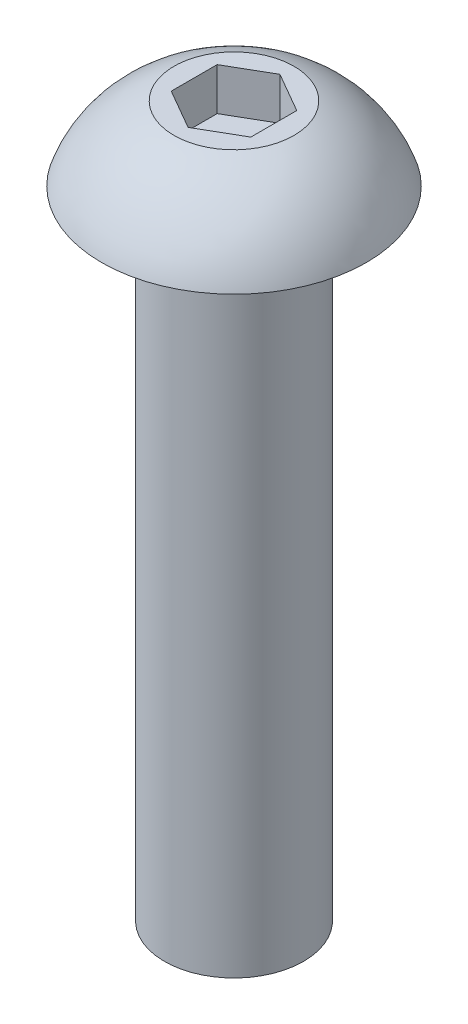
ISO-10303-21;
HEADER;
FILE_DESCRIPTION(('STEP AP214'),'2;1');
FILE_NAME('part.step','',(''),(''),'','','');
FILE_SCHEMA(('AUTOMOTIVE_DESIGN { 1 0 10303 214 1 1 1 1 }'));
ENDSEC;
DATA;
#1=APPLICATION_CONTEXT('core data for automotive mechanical design processes');
#2=APPLICATION_PROTOCOL_DEFINITION('international standard','automotive_design',2000,#1);
#3=PRODUCT_CONTEXT('',#1,'mechanical');
#4=PRODUCT('Part','Part','',(#3));
#5=PRODUCT_RELATED_PRODUCT_CATEGORY('part','',(#4));
#6=PRODUCT_DEFINITION_FORMATION('','',#4);
#7=PRODUCT_DEFINITION_CONTEXT('part definition',#1,'design');
#8=PRODUCT_DEFINITION('design','',#6,#7);
#9=PRODUCT_DEFINITION_SHAPE('','',#8);
#10=(LENGTH_UNIT() NAMED_UNIT(*) SI_UNIT(.MILLI.,.METRE.));
#11=(NAMED_UNIT(*) PLANE_ANGLE_UNIT() SI_UNIT($,.RADIAN.));
#12=(NAMED_UNIT(*) SI_UNIT($,.STERADIAN.) SOLID_ANGLE_UNIT());
#13=UNCERTAINTY_MEASURE_WITH_UNIT(LENGTH_MEASURE(1.E-05),#10,'distance_accuracy_value','');
#14=(GEOMETRIC_REPRESENTATION_CONTEXT(3) GLOBAL_UNCERTAINTY_ASSIGNED_CONTEXT((#13)) GLOBAL_UNIT_ASSIGNED_CONTEXT((#10,
#11,#12)) REPRESENTATION_CONTEXT('',''));
#15=CARTESIAN_POINT('',(0.,0.,0.));
#16=DIRECTION('',(0.,0.,1.));
#17=DIRECTION('',(1.,0.,0.));
#18=AXIS2_PLACEMENT_3D('',#15,#16,#17);
#19=CARTESIAN_POINT('',(0.,-19.05,0.));
#20=DIRECTION('',(0.,-1.,0.));
#21=DIRECTION('',(1.,0.,0.));
#22=AXIS2_PLACEMENT_3D('',#19,#20,#21);
#23=CYLINDRICAL_SURFACE('',#22,2.0828);
#24=CARTESIAN_POINT('',(0.,-19.05,0.));
#25=DIRECTION('',(0.,-1.,0.));
#26=DIRECTION('',(1.,0.,0.));
#27=AXIS2_PLACEMENT_3D('',#24,#25,#26);
#28=CIRCLE('',#27,2.0828);
#29=CARTESIAN_POINT('',(2.0828,-19.05,0.));
#30=VERTEX_POINT('',#29);
#31=EDGE_CURVE('E136',#30,#30,#28,.T.);
#32=ORIENTED_EDGE('',*,*,#31,.F.);
#33=EDGE_LOOP('',(#32));
#34=FACE_BOUND('',#33,.T.);
#35=CARTESIAN_POINT('',(0.,0.,0.));
#36=DIRECTION('',(0.,-1.,0.));
#37=DIRECTION('',(1.,0.,0.));
#38=AXIS2_PLACEMENT_3D('',#35,#36,#37);
#39=CIRCLE('',#38,2.0828);
#40=CARTESIAN_POINT('',(2.0828,0.,0.));
#41=VERTEX_POINT('',#40);
#42=EDGE_CURVE('E11',#41,#41,#39,.T.);
#43=ORIENTED_EDGE('',*,*,#42,.T.);
#44=EDGE_LOOP('',(#43));
#45=FACE_BOUND('',#44,.T.);
#46=ADVANCED_FACE('F35',(#34,#45),#23,.T.);
#47=CARTESIAN_POINT('',(-2.0828,0.,0.));
#48=DIRECTION('',(0.,1.,0.));
#49=DIRECTION('',(-1.,0.,0.));
#50=AXIS2_PLACEMENT_3D('',#47,#48,#49);
#51=PLANE('',#50);
#52=ORIENTED_EDGE('',*,*,#42,.F.);
#53=EDGE_LOOP('',(#52));
#54=FACE_BOUND('',#53,.T.);
#55=CARTESIAN_POINT('',(0.,0.,0.));
#56=DIRECTION('',(0.,-1.,0.));
#57=DIRECTION('',(1.,0.,0.));
#58=AXIS2_PLACEMENT_3D('',#55,#56,#57);
#59=CIRCLE('',#58,3.9624);
#60=CARTESIAN_POINT('',(3.9624,0.,0.));
#61=VERTEX_POINT('',#60);
#62=EDGE_CURVE('E42',#61,#61,#59,.T.);
#63=ORIENTED_EDGE('',*,*,#62,.T.);
#64=EDGE_LOOP('',(#63));
#65=FACE_BOUND('',#64,.T.);
#66=ADVANCED_FACE('F149',(#54,#65),#51,.F.);
#67=CARTESIAN_POINT('',(0.,-1.14110107621728,0.));
#68=DIRECTION('',(0.,-1.,0.));
#69=DIRECTION('',(1.,0.,0.));
#70=AXIS2_PLACEMENT_3D('',#67,#68,#69);
#71=DEGENERATE_TOROIDAL_SURFACE('',#70,0.588889242879197,3.5612759643917,.T.);
#72=ORIENTED_EDGE('',*,*,#62,.F.);
#73=EDGE_LOOP('',(#72));
#74=FACE_BOUND('',#73,.T.);
#75=CARTESIAN_POINT('',(0.,2.2098,0.));
#76=DIRECTION('',(0.,-1.,0.));
#77=DIRECTION('',(1.,0.,0.));
#78=AXIS2_PLACEMENT_3D('',#75,#76,#77);
#79=CIRCLE('',#78,1.7947700296736);
#80=CARTESIAN_POINT('',(1.7947700296736,2.2098,0.));
#81=VERTEX_POINT('',#80);
#82=EDGE_CURVE('E144',#81,#81,#79,.T.);
#83=ORIENTED_EDGE('',*,*,#82,.T.);
#84=EDGE_LOOP('',(#83));
#85=FACE_BOUND('',#84,.T.);
#86=ADVANCED_FACE('F151',(#74,#85),#71,.T.);
#87=CARTESIAN_POINT('',(0.,2.2098,0.));
#88=DIRECTION('',(0.,-1.,0.));
#89=DIRECTION('',(1.,0.,0.));
#90=AXIS2_PLACEMENT_3D('',#87,#88,#89);
#91=PLANE('',#90);
#92=DIRECTION('',(0.,0.,1.));
#93=VECTOR('',#92,1.);
#94=CARTESIAN_POINT('',(-1.190625,2.2098,-0.687407664253898));
#95=LINE('',#94,#93);
#96=CARTESIAN_POINT('',(-1.190625,2.2098,-0.687407664253898));
#97=VERTEX_POINT('',#96);
#98=CARTESIAN_POINT('',(-1.190625,2.2098,0.687407664253898));
#99=VERTEX_POINT('',#98);
#100=EDGE_CURVE('E123',#97,#99,#95,.T.);
#101=ORIENTED_EDGE('',*,*,#100,.F.);
#102=DIRECTION('',(-0.866025403784439,0.,0.5));
#103=VECTOR('',#102,1.);
#104=CARTESIAN_POINT('',(0.,2.2098,-1.3748153285078));
#105=LINE('',#104,#103);
#106=CARTESIAN_POINT('',(0.,2.2098,-1.3748153285078));
#107=VERTEX_POINT('',#106);
#108=EDGE_CURVE('E49',#107,#97,#105,.T.);
#109=ORIENTED_EDGE('',*,*,#108,.F.);
#110=DIRECTION('',(-0.866025403784439,0.,-0.5));
#111=VECTOR('',#110,1.);
#112=CARTESIAN_POINT('',(1.190625,2.2098,-0.687407664253898));
#113=LINE('',#112,#111);
#114=CARTESIAN_POINT('',(1.190625,2.2098,-0.687407664253898));
#115=VERTEX_POINT('',#114);
#116=EDGE_CURVE('E132',#115,#107,#113,.T.);
#117=ORIENTED_EDGE('',*,*,#116,.F.);
#118=DIRECTION('',(0.,0.,-1.));
#119=VECTOR('',#118,1.);
#120=CARTESIAN_POINT('',(1.190625,2.2098,0.687407664253898));
#121=LINE('',#120,#119);
#122=CARTESIAN_POINT('',(1.190625,2.2098,0.687407664253898));
#123=VERTEX_POINT('',#122);
#124=EDGE_CURVE('E130',#123,#115,#121,.T.);
#125=ORIENTED_EDGE('',*,*,#124,.F.);
#126=DIRECTION('',(0.866025403784438,0.,-0.5));
#127=VECTOR('',#126,1.);
#128=CARTESIAN_POINT('',(0.,2.2098,1.3748153285078));
#129=LINE('',#128,#127);
#130=CARTESIAN_POINT('',(0.,2.2098,1.3748153285078));
#131=VERTEX_POINT('',#130);
#132=EDGE_CURVE('E97',#131,#123,#129,.T.);
#133=ORIENTED_EDGE('',*,*,#132,.F.);
#134=DIRECTION('',(0.866025403784439,0.,0.5));
#135=VECTOR('',#134,1.);
#136=CARTESIAN_POINT('',(-1.190625,2.2098,0.687407664253898));
#137=LINE('',#136,#135);
#138=EDGE_CURVE('E126',#99,#131,#137,.T.);
#139=ORIENTED_EDGE('',*,*,#138,.F.);
#140=EDGE_LOOP('',(#101,#109,#117,#125,#133,#139));
#141=FACE_BOUND('',#140,.T.);
#142=ORIENTED_EDGE('',*,*,#82,.F.);
#143=EDGE_LOOP('',(#142));
#144=FACE_BOUND('',#143,.T.);
#145=ADVANCED_FACE('F154',(#141,#144),#91,.F.);
#146=CARTESIAN_POINT('',(-2.0828,-19.05,0.));
#147=DIRECTION('',(0.,1.,0.));
#148=DIRECTION('',(-1.,0.,0.));
#149=AXIS2_PLACEMENT_3D('',#146,#147,#148);
#150=PLANE('',#149);
#151=ORIENTED_EDGE('',*,*,#31,.T.);
#152=EDGE_LOOP('',(#151));
#153=FACE_BOUND('',#152,.T.);
#154=ADVANCED_FACE('F159',(#153),#150,.F.);
#155=CARTESIAN_POINT('',(0.,0.939799999999999,-1.3748153285078));
#156=DIRECTION('',(-0.5,0.,-0.866025403784439));
#157=DIRECTION('',(-0.866025403784439,0.,0.5));
#158=AXIS2_PLACEMENT_3D('',#155,#156,#157);
#159=PLANE('',#158);
#160=ORIENTED_EDGE('',*,*,#108,.T.);
#161=DIRECTION('',(0.,1.,0.));
#162=VECTOR('',#161,1.);
#163=CARTESIAN_POINT('',(-1.190625,0.939799999999999,-0.687407664253898));
#164=LINE('',#163,#162);
#165=CARTESIAN_POINT('',(-1.190625,0.939799999999999,-0.687407664253898));
#166=VERTEX_POINT('',#165);
#167=EDGE_CURVE('E79',#166,#97,#164,.T.);
#168=ORIENTED_EDGE('',*,*,#167,.F.);
#169=DIRECTION('',(-0.866025403784439,0.,0.5));
#170=VECTOR('',#169,1.);
#171=CARTESIAN_POINT('',(0.,0.939799999999999,-1.3748153285078));
#172=LINE('',#171,#170);
#173=CARTESIAN_POINT('',(0.,0.939799999999999,-1.3748153285078));
#174=VERTEX_POINT('',#173);
#175=EDGE_CURVE('E134',#174,#166,#172,.T.);
#176=ORIENTED_EDGE('',*,*,#175,.F.);
#177=DIRECTION('',(0.,1.,0.));
#178=VECTOR('',#177,1.);
#179=CARTESIAN_POINT('',(0.,0.939799999999999,-1.3748153285078));
#180=LINE('',#179,#178);
#181=EDGE_CURVE('E57',#174,#107,#180,.T.);
#182=ORIENTED_EDGE('',*,*,#181,.T.);
#183=EDGE_LOOP('',(#160,#168,#176,#182));
#184=FACE_BOUND('',#183,.T.);
#185=ADVANCED_FACE('F165',(#184),#159,.F.);
#186=CARTESIAN_POINT('',(1.190625,0.939799999999999,-0.687407664253898));
#187=DIRECTION('',(0.5,0.,-0.866025403784439));
#188=DIRECTION('',(-0.866025403784439,0.,-0.5));
#189=AXIS2_PLACEMENT_3D('',#186,#187,#188);
#190=PLANE('',#189);
#191=ORIENTED_EDGE('',*,*,#116,.T.);
#192=ORIENTED_EDGE('',*,*,#181,.F.);
#193=DIRECTION('',(-0.866025403784439,0.,-0.5));
#194=VECTOR('',#193,1.);
#195=CARTESIAN_POINT('',(1.190625,0.939799999999999,-0.687407664253898));
#196=LINE('',#195,#194);
#197=CARTESIAN_POINT('',(1.190625,0.939799999999999,-0.687407664253898));
#198=VERTEX_POINT('',#197);
#199=EDGE_CURVE('E109',#198,#174,#196,.T.);
#200=ORIENTED_EDGE('',*,*,#199,.F.);
#201=DIRECTION('',(0.,1.,0.));
#202=VECTOR('',#201,1.);
#203=CARTESIAN_POINT('',(1.190625,0.939799999999999,-0.687407664253898));
#204=LINE('',#203,#202);
#205=EDGE_CURVE('E101',#198,#115,#204,.T.);
#206=ORIENTED_EDGE('',*,*,#205,.T.);
#207=EDGE_LOOP('',(#191,#192,#200,#206));
#208=FACE_BOUND('',#207,.T.);
#209=ADVANCED_FACE('F203',(#208),#190,.F.);
#210=CARTESIAN_POINT('',(1.190625,0.939799999999999,0.687407664253898));
#211=DIRECTION('',(1.,0.,0.));
#212=DIRECTION('',(0.,0.,-1.));
#213=AXIS2_PLACEMENT_3D('',#210,#211,#212);
#214=PLANE('',#213);
#215=ORIENTED_EDGE('',*,*,#124,.T.);
#216=ORIENTED_EDGE('',*,*,#205,.F.);
#217=DIRECTION('',(0.,0.,-1.));
#218=VECTOR('',#217,1.);
#219=CARTESIAN_POINT('',(1.190625,0.939799999999999,0.687407664253898));
#220=LINE('',#219,#218);
#221=CARTESIAN_POINT('',(1.190625,0.939799999999999,0.687407664253898));
#222=VERTEX_POINT('',#221);
#223=EDGE_CURVE('E105',#222,#198,#220,.T.);
#224=ORIENTED_EDGE('',*,*,#223,.F.);
#225=DIRECTION('',(0.,1.,0.));
#226=VECTOR('',#225,1.);
#227=CARTESIAN_POINT('',(1.190625,0.939799999999999,0.687407664253898));
#228=LINE('',#227,#226);
#229=EDGE_CURVE('E90',#222,#123,#228,.T.);
#230=ORIENTED_EDGE('',*,*,#229,.T.);
#231=EDGE_LOOP('',(#215,#216,#224,#230));
#232=FACE_BOUND('',#231,.T.);
#233=ADVANCED_FACE('F106',(#232),#214,.F.);
#234=CARTESIAN_POINT('',(0.,0.939799999999999,1.3748153285078));
#235=DIRECTION('',(0.5,0.,0.866025403784438));
#236=DIRECTION('',(0.866025403784439,0.,-0.5));
#237=AXIS2_PLACEMENT_3D('',#234,#235,#236);
#238=PLANE('',#237);
#239=ORIENTED_EDGE('',*,*,#132,.T.);
#240=ORIENTED_EDGE('',*,*,#229,.F.);
#241=DIRECTION('',(0.866025403784438,0.,-0.5));
#242=VECTOR('',#241,1.);
#243=CARTESIAN_POINT('',(0.,0.939799999999999,1.3748153285078));
#244=LINE('',#243,#242);
#245=CARTESIAN_POINT('',(0.,0.939799999999999,1.3748153285078));
#246=VERTEX_POINT('',#245);
#247=EDGE_CURVE('E94',#246,#222,#244,.T.);
#248=ORIENTED_EDGE('',*,*,#247,.F.);
#249=DIRECTION('',(0.,1.,0.));
#250=VECTOR('',#249,1.);
#251=CARTESIAN_POINT('',(0.,0.939799999999999,1.3748153285078));
#252=LINE('',#251,#250);
#253=EDGE_CURVE('E102',#246,#131,#252,.T.);
#254=ORIENTED_EDGE('',*,*,#253,.T.);
#255=EDGE_LOOP('',(#239,#240,#248,#254));
#256=FACE_BOUND('',#255,.T.);
#257=ADVANCED_FACE('F92',(#256),#238,.F.);
#258=CARTESIAN_POINT('',(-1.190625,0.939799999999999,0.687407664253898));
#259=DIRECTION('',(-0.5,0.,0.866025403784439));
#260=DIRECTION('',(0.866025403784439,0.,0.5));
#261=AXIS2_PLACEMENT_3D('',#258,#259,#260);
#262=PLANE('',#261);
#263=ORIENTED_EDGE('',*,*,#138,.T.);
#264=ORIENTED_EDGE('',*,*,#253,.F.);
#265=DIRECTION('',(0.866025403784439,0.,0.5));
#266=VECTOR('',#265,1.);
#267=CARTESIAN_POINT('',(-1.190625,0.939799999999999,0.687407664253898));
#268=LINE('',#267,#266);
#269=CARTESIAN_POINT('',(-1.190625,0.939799999999999,0.687407664253898));
#270=VERTEX_POINT('',#269);
#271=EDGE_CURVE('E115',#270,#246,#268,.T.);
#272=ORIENTED_EDGE('',*,*,#271,.F.);
#273=DIRECTION('',(0.,1.,0.));
#274=VECTOR('',#273,1.);
#275=CARTESIAN_POINT('',(-1.190625,0.939799999999999,0.687407664253898));
#276=LINE('',#275,#274);
#277=EDGE_CURVE('E139',#270,#99,#276,.T.);
#278=ORIENTED_EDGE('',*,*,#277,.T.);
#279=EDGE_LOOP('',(#263,#264,#272,#278));
#280=FACE_BOUND('',#279,.T.);
#281=ADVANCED_FACE('F228',(#280),#262,.F.);
#282=CARTESIAN_POINT('',(-1.190625,0.939799999999999,-0.687407664253898));
#283=DIRECTION('',(-1.,0.,0.));
#284=DIRECTION('',(0.,0.,1.));
#285=AXIS2_PLACEMENT_3D('',#282,#283,#284);
#286=PLANE('',#285);
#287=ORIENTED_EDGE('',*,*,#100,.T.);
#288=ORIENTED_EDGE('',*,*,#277,.F.);
#289=DIRECTION('',(0.,0.,1.));
#290=VECTOR('',#289,1.);
#291=CARTESIAN_POINT('',(-1.190625,0.939799999999999,-0.687407664253898));
#292=LINE('',#291,#290);
#293=EDGE_CURVE('E117',#166,#270,#292,.T.);
#294=ORIENTED_EDGE('',*,*,#293,.F.);
#295=ORIENTED_EDGE('',*,*,#167,.T.);
#296=EDGE_LOOP('',(#287,#288,#294,#295));
#297=FACE_BOUND('',#296,.T.);
#298=ADVANCED_FACE('F237',(#297),#286,.F.);
#299=CARTESIAN_POINT('',(0.,0.939799999999999,0.));
#300=DIRECTION('',(0.,1.,0.));
#301=DIRECTION('',(0.,0.,1.));
#302=AXIS2_PLACEMENT_3D('',#299,#300,#301);
#303=PLANE('',#302);
#304=ORIENTED_EDGE('',*,*,#175,.T.);
#305=ORIENTED_EDGE('',*,*,#293,.T.);
#306=ORIENTED_EDGE('',*,*,#271,.T.);
#307=ORIENTED_EDGE('',*,*,#247,.T.);
#308=ORIENTED_EDGE('',*,*,#223,.T.);
#309=ORIENTED_EDGE('',*,*,#199,.T.);
#310=EDGE_LOOP('',(#304,#305,#306,#307,#308,#309));
#311=FACE_BOUND('',#310,.T.);
#312=ADVANCED_FACE('F112',(#311),#303,.T.);
#313=CLOSED_SHELL('',(#46,#66,#86,#145,#154,#185,#209,#233,#257,#281,#298,#312));
#314=MANIFOLD_SOLID_BREP('B2',#313);
#315=ADVANCED_BREP_SHAPE_REPRESENTATION('',(#18,#314),#14);
#316=SHAPE_DEFINITION_REPRESENTATION(#9,#315);
ENDSEC;
END-ISO-10303-21;
